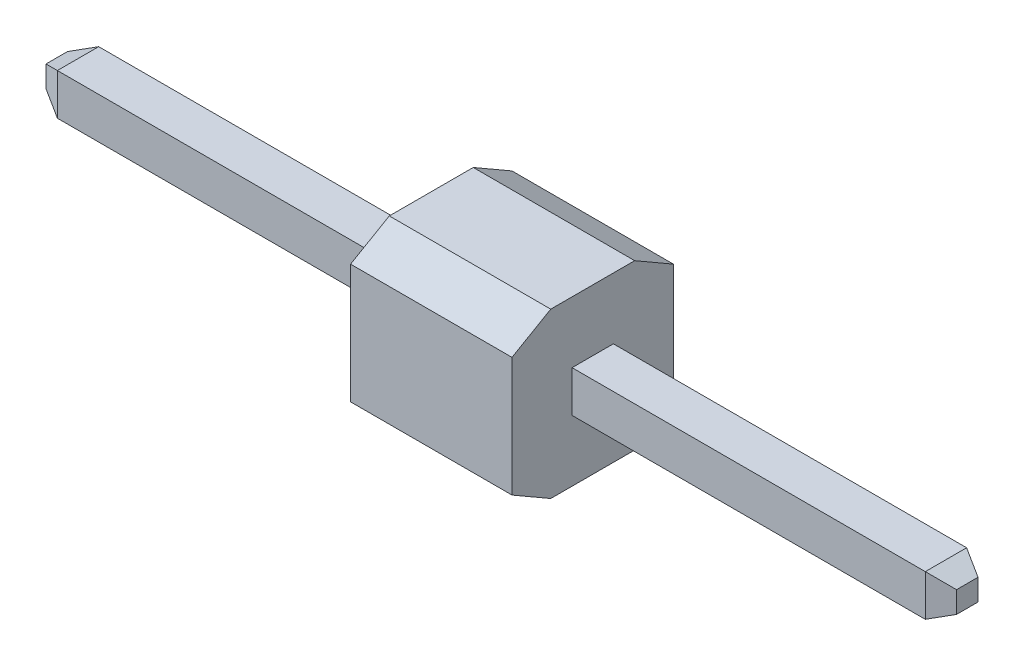
ISO-10303-21;
HEADER;
FILE_DESCRIPTION(('STEP AP214'),'2;1');
FILE_NAME('part.step','',(''),(''),'','','');
FILE_SCHEMA(('AUTOMOTIVE_DESIGN { 1 0 10303 214 1 1 1 1 }'));
ENDSEC;
DATA;
#1=APPLICATION_CONTEXT('core data for automotive mechanical design processes');
#2=APPLICATION_PROTOCOL_DEFINITION('international standard','automotive_design',2000,#1);
#3=PRODUCT_CONTEXT('',#1,'mechanical');
#4=PRODUCT('Part','Part','',(#3));
#5=PRODUCT_RELATED_PRODUCT_CATEGORY('part','',(#4));
#6=PRODUCT_DEFINITION_FORMATION('','',#4);
#7=PRODUCT_DEFINITION_CONTEXT('part definition',#1,'design');
#8=PRODUCT_DEFINITION('design','',#6,#7);
#9=PRODUCT_DEFINITION_SHAPE('','',#8);
#10=(LENGTH_UNIT() NAMED_UNIT(*) SI_UNIT(.MILLI.,.METRE.));
#11=(NAMED_UNIT(*) PLANE_ANGLE_UNIT() SI_UNIT($,.RADIAN.));
#12=(NAMED_UNIT(*) SI_UNIT($,.STERADIAN.) SOLID_ANGLE_UNIT());
#13=UNCERTAINTY_MEASURE_WITH_UNIT(LENGTH_MEASURE(1.E-05),#10,'distance_accuracy_value','');
#14=(GEOMETRIC_REPRESENTATION_CONTEXT(3) GLOBAL_UNCERTAINTY_ASSIGNED_CONTEXT((#13)) GLOBAL_UNIT_ASSIGNED_CONTEXT((#10,
#11,#12)) REPRESENTATION_CONTEXT('',''));
#15=CARTESIAN_POINT('',(0.,0.,0.));
#16=DIRECTION('',(0.,0.,1.));
#17=DIRECTION('',(1.,0.,0.));
#18=AXIS2_PLACEMENT_3D('',#15,#16,#17);
#19=CARTESIAN_POINT('',(5.4210759044697,2.85711572605714,-2.77112081761862));
#20=DIRECTION('',(1.,-9.93476518829084E-08,4.37113882867379E-08));
#21=DIRECTION('',(-9.93476589883358E-08,-1.,8.74227765734759E-08));
#22=AXIS2_PLACEMENT_3D('',#19,#20,#21);
#23=PLANE('',#22);
#24=DIRECTION('',(-1.18186632779335E-08,-0.50000007571054,-0.866025360072933));
#25=VECTOR('',#24,1.);
#26=CARTESIAN_POINT('',(5.42107571229509,1.61352602482091,-1.20112070890054));
#27=LINE('',#26,#25);
#28=CARTESIAN_POINT('',(5.42107571229509,1.61352602482091,-1.20112070890054));
#29=VERTEX_POINT('',#28);
#30=CARTESIAN_POINT('',(5.42107570410688,1.26711581085724,-1.8011206786164));
#31=VERTEX_POINT('',#30);
#32=EDGE_CURVE('E11',#29,#31,#27,.T.);
#33=ORIENTED_EDGE('',*,*,#32,.T.);
#34=DIRECTION('',(4.37113811813104E-08,-8.74227828590458E-08,-0.999999999999995));
#35=VECTOR('',#34,1.);
#36=CARTESIAN_POINT('',(5.42107570410688,1.26711581085724,-1.8011206786164));
#37=LINE('',#36,#35);
#38=CARTESIAN_POINT('',(5.42107576093168,1.26711569720762,-3.1011206786164));
#39=VERTEX_POINT('',#38);
#40=EDGE_CURVE('E304',#31,#39,#37,.T.);
#41=ORIENTED_EDGE('',*,*,#40,.T.);
#42=DIRECTION('',(8.75289963531795E-08,0.499999924289837,-0.866025447495713));
#43=VECTOR('',#42,1.);
#44=CARTESIAN_POINT('',(5.42107576093168,1.26711569720762,-3.1011206786164));
#45=LINE('',#44,#43);
#46=CARTESIAN_POINT('',(5.42107582157355,1.61352580626395,-3.70112070890054));
#47=VERTEX_POINT('',#46);
#48=EDGE_CURVE('E296',#39,#47,#45,.T.);
#49=ORIENTED_EDGE('',*,*,#48,.T.);
#50=DIRECTION('',(9.93476588436478E-08,0.999999999999991,-8.74227764822788E-08));
#51=VECTOR('',#50,1.);
#52=CARTESIAN_POINT('',(5.42107582157355,1.61352580626395,-3.70112070890054));
#53=LINE('',#52,#51);
#54=CARTESIAN_POINT('',(5.42107600508652,3.46070548323395,-3.70112087038612));
#55=VERTEX_POINT('',#54);
#56=EDGE_CURVE('E281',#47,#55,#53,.T.);
#57=ORIENTED_EDGE('',*,*,#56,.T.);
#58=DIRECTION('',(-1.18186619958731E-08,-0.500000075710537,-0.866025360072935));
#59=VECTOR('',#58,1.);
#60=CARTESIAN_POINT('',(5.42107601327473,3.80711569720762,-3.10112090067026));
#61=LINE('',#60,#59);
#62=CARTESIAN_POINT('',(5.42107601327473,3.80711569720762,-3.10112090067026));
#63=VERTEX_POINT('',#62);
#64=EDGE_CURVE('E265',#63,#55,#61,.T.);
#65=ORIENTED_EDGE('',*,*,#64,.F.);
#66=DIRECTION('',(4.37113811813104E-08,-8.74227814926175E-08,-0.999999999999995));
#67=VECTOR('',#66,1.);
#68=CARTESIAN_POINT('',(5.42107595644994,3.80711581085724,-1.80112090067026));
#69=LINE('',#68,#67);
#70=CARTESIAN_POINT('',(5.42107595644994,3.80711581085724,-1.80112090067026));
#71=VERTEX_POINT('',#70);
#72=EDGE_CURVE('E248',#71,#63,#69,.T.);
#73=ORIENTED_EDGE('',*,*,#72,.F.);
#74=DIRECTION('',(8.75289963525478E-08,0.499999924289836,-0.866025447495714));
#75=VECTOR('',#74,1.);
#76=CARTESIAN_POINT('',(5.42107589580807,3.46070570179091,-1.20112087038612));
#77=LINE('',#76,#75);
#78=CARTESIAN_POINT('',(5.42107589580807,3.46070570179091,-1.20112087038612));
#79=VERTEX_POINT('',#78);
#80=EDGE_CURVE('E242',#79,#71,#77,.T.);
#81=ORIENTED_EDGE('',*,*,#80,.F.);
#82=DIRECTION('',(9.93476588436478E-08,0.999999999999991,-8.74227763620714E-08));
#83=VECTOR('',#82,1.);
#84=CARTESIAN_POINT('',(5.42107571229509,1.61352602482091,-1.20112070890054));
#85=LINE('',#84,#83);
#86=EDGE_CURVE('E236',#29,#79,#85,.T.);
#87=ORIENTED_EDGE('',*,*,#86,.F.);
#88=EDGE_LOOP('',(#33,#41,#49,#57,#65,#73,#81,#87));
#89=FACE_BOUND('',#88,.T.);
#90=DIRECTION('',(-4.37113817364219E-08,8.74227801261891E-08,0.999999999999995));
#91=VECTOR('',#90,1.);
#92=CARTESIAN_POINT('',(5.4210758408872,2.21711572605714,-2.77112076166804));
#93=LINE('',#92,#91);
#94=CARTESIAN_POINT('',(5.4210758408872,2.21711572605714,-2.77112076166804));
#95=VERTEX_POINT('',#94);
#96=CARTESIAN_POINT('',(5.42107581291191,2.21711578200772,-2.13112076166804));
#97=VERTEX_POINT('',#96);
#98=EDGE_CURVE('E302',#95,#97,#93,.T.);
#99=ORIENTED_EDGE('',*,*,#98,.T.);
#100=DIRECTION('',(-9.93476592658908E-08,-0.999999999999991,8.7422776656742E-08));
#101=VECTOR('',#100,1.);
#102=CARTESIAN_POINT('',(5.42107587649442,2.85711578200772,-2.13112081761862));
#103=LINE('',#102,#101);
#104=CARTESIAN_POINT('',(5.42107587649442,2.85711578200772,-2.13112081761862));
#105=VERTEX_POINT('',#104);
#106=EDGE_CURVE('E293',#105,#97,#103,.T.);
#107=ORIENTED_EDGE('',*,*,#106,.F.);
#108=DIRECTION('',(-4.37113817364219E-08,8.74227829017466E-08,0.999999999999995));
#109=VECTOR('',#108,1.);
#110=CARTESIAN_POINT('',(5.4210759044697,2.85711572605714,-2.77112081761862));
#111=LINE('',#110,#109);
#112=CARTESIAN_POINT('',(5.4210759044697,2.85711572605714,-2.77112081761862));
#113=VERTEX_POINT('',#112);
#114=EDGE_CURVE('E278',#113,#105,#111,.T.);
#115=ORIENTED_EDGE('',*,*,#114,.F.);
#116=DIRECTION('',(-9.93476592658908E-08,-0.999999999999991,8.7422776656742E-08));
#117=VECTOR('',#116,1.);
#118=CARTESIAN_POINT('',(5.4210759044697,2.85711572605714,-2.77112081761862));
#119=LINE('',#118,#117);
#120=EDGE_CURVE('E263',#113,#95,#119,.T.);
#121=ORIENTED_EDGE('',*,*,#120,.T.);
#122=EDGE_LOOP('',(#99,#107,#115,#121));
#123=FACE_BOUND('',#122,.T.);
#124=ADVANCED_FACE('F17',(#89,#123),#23,.T.);
#125=CARTESIAN_POINT('',(2.9210759044697,2.85711597442627,-2.77112092689709));
#126=DIRECTION('',(1.,-9.93476518829084E-08,4.37113882867379E-08));
#127=DIRECTION('',(-9.93476589883358E-08,-1.,8.74227765734759E-08));
#128=AXIS2_PLACEMENT_3D('',#125,#126,#127);
#129=PLANE('',#128);
#130=DIRECTION('',(-1.18186632779335E-08,-0.50000007571054,-0.866025360072933));
#131=VECTOR('',#130,1.);
#132=CARTESIAN_POINT('',(2.92107571229509,1.61352627319004,-1.20112081817901));
#133=LINE('',#132,#131);
#134=CARTESIAN_POINT('',(2.92107571229509,1.61352627319004,-1.20112081817901));
#135=VERTEX_POINT('',#134);
#136=CARTESIAN_POINT('',(2.92107570410688,1.26711605922637,-1.80112078789487));
#137=VERTEX_POINT('',#136);
#138=EDGE_CURVE('E24',#135,#137,#133,.T.);
#139=ORIENTED_EDGE('',*,*,#138,.F.);
#140=DIRECTION('',(9.93476588436478E-08,0.999999999999991,-8.74227763620714E-08));
#141=VECTOR('',#140,1.);
#142=CARTESIAN_POINT('',(2.92107571229509,1.61352627319004,-1.20112081817901));
#143=LINE('',#142,#141);
#144=CARTESIAN_POINT('',(2.92107589580807,3.46070595016004,-1.20112097966459));
#145=VERTEX_POINT('',#144);
#146=EDGE_CURVE('E300',#135,#145,#143,.T.);
#147=ORIENTED_EDGE('',*,*,#146,.T.);
#148=DIRECTION('',(8.75289963525478E-08,0.499999924289836,-0.866025447495714));
#149=VECTOR('',#148,1.);
#150=CARTESIAN_POINT('',(2.92107589580807,3.46070595016004,-1.20112097966459));
#151=LINE('',#150,#149);
#152=CARTESIAN_POINT('',(2.92107595644994,3.80711605922637,-1.80112100994873));
#153=VERTEX_POINT('',#152);
#154=EDGE_CURVE('E286',#145,#153,#151,.T.);
#155=ORIENTED_EDGE('',*,*,#154,.T.);
#156=DIRECTION('',(4.37113811813104E-08,-8.74227814926175E-08,-0.999999999999995));
#157=VECTOR('',#156,1.);
#158=CARTESIAN_POINT('',(2.92107595644994,3.80711605922637,-1.80112100994873));
#159=LINE('',#158,#157);
#160=CARTESIAN_POINT('',(2.92107601327473,3.80711594557675,-3.10112100994873));
#161=VERTEX_POINT('',#160);
#162=EDGE_CURVE('E271',#153,#161,#159,.T.);
#163=ORIENTED_EDGE('',*,*,#162,.T.);
#164=DIRECTION('',(-1.18186626368607E-08,-0.500000075710537,-0.866025360072935));
#165=VECTOR('',#164,1.);
#166=CARTESIAN_POINT('',(2.92107601327473,3.80711594557675,-3.10112100994873));
#167=LINE('',#166,#165);
#168=CARTESIAN_POINT('',(2.92107600508652,3.46070573160308,-3.70112097966459));
#169=VERTEX_POINT('',#168);
#170=EDGE_CURVE('E253',#161,#169,#167,.T.);
#171=ORIENTED_EDGE('',*,*,#170,.T.);
#172=DIRECTION('',(9.93476588436478E-08,0.999999999999991,-8.74227764822788E-08));
#173=VECTOR('',#172,1.);
#174=CARTESIAN_POINT('',(2.92107582157355,1.61352605463308,-3.70112081817901));
#175=LINE('',#174,#173);
#176=CARTESIAN_POINT('',(2.92107582157355,1.61352605463308,-3.70112081817901));
#177=VERTEX_POINT('',#176);
#178=EDGE_CURVE('E261',#177,#169,#175,.T.);
#179=ORIENTED_EDGE('',*,*,#178,.F.);
#180=DIRECTION('',(8.75289963531795E-08,0.499999924289837,-0.866025447495713));
#181=VECTOR('',#180,1.);
#182=CARTESIAN_POINT('',(2.92107576093168,1.26711594557675,-3.10112078789487));
#183=LINE('',#182,#181);
#184=CARTESIAN_POINT('',(2.92107576093168,1.26711594557675,-3.10112078789487));
#185=VERTEX_POINT('',#184);
#186=EDGE_CURVE('E276',#185,#177,#183,.T.);
#187=ORIENTED_EDGE('',*,*,#186,.F.);
#188=DIRECTION('',(4.37113811813104E-08,-8.74227828590458E-08,-0.999999999999995));
#189=VECTOR('',#188,1.);
#190=CARTESIAN_POINT('',(2.92107570410688,1.26711605922637,-1.80112078789487));
#191=LINE('',#190,#189);
#192=EDGE_CURVE('E291',#137,#185,#191,.T.);
#193=ORIENTED_EDGE('',*,*,#192,.F.);
#194=EDGE_LOOP('',(#139,#147,#155,#163,#171,#179,#187,#193));
#195=FACE_BOUND('',#194,.T.);
#196=DIRECTION('',(-9.93476585720014E-08,-0.999999999999991,8.7422776656742E-08));
#197=VECTOR('',#196,1.);
#198=CARTESIAN_POINT('',(2.92107587649442,2.85711603037685,-2.13112092689709));
#199=LINE('',#198,#197);
#200=CARTESIAN_POINT('',(2.92107587649442,2.85711603037685,-2.13112092689709));
#201=VERTEX_POINT('',#200);
#202=CARTESIAN_POINT('',(2.92107581291191,2.21711603037685,-2.13112087094651));
#203=VERTEX_POINT('',#202);
#204=EDGE_CURVE('E298',#201,#203,#199,.T.);
#205=ORIENTED_EDGE('',*,*,#204,.T.);
#206=DIRECTION('',(-4.37113810425325E-08,8.74227801261891E-08,0.999999999999995));
#207=VECTOR('',#206,1.);
#208=CARTESIAN_POINT('',(2.9210758408872,2.21711597442627,-2.77112087094651));
#209=LINE('',#208,#207);
#210=CARTESIAN_POINT('',(2.9210758408872,2.21711597442627,-2.77112087094651));
#211=VERTEX_POINT('',#210);
#212=EDGE_CURVE('E283',#211,#203,#209,.T.);
#213=ORIENTED_EDGE('',*,*,#212,.F.);
#214=DIRECTION('',(-9.93476592658908E-08,-0.999999999999991,8.7422776656742E-08));
#215=VECTOR('',#214,1.);
#216=CARTESIAN_POINT('',(2.9210759044697,2.85711597442627,-2.77112092689709));
#217=LINE('',#216,#215);
#218=CARTESIAN_POINT('',(2.9210759044697,2.85711597442627,-2.77112092689709));
#219=VERTEX_POINT('',#218);
#220=EDGE_CURVE('E268',#219,#211,#217,.T.);
#221=ORIENTED_EDGE('',*,*,#220,.F.);
#222=DIRECTION('',(-4.37113817364219E-08,8.74227829017466E-08,0.999999999999995));
#223=VECTOR('',#222,1.);
#224=CARTESIAN_POINT('',(2.9210759044697,2.85711597442627,-2.77112092689709));
#225=LINE('',#224,#223);
#226=EDGE_CURVE('E251',#219,#201,#225,.T.);
#227=ORIENTED_EDGE('',*,*,#226,.T.);
#228=EDGE_LOOP('',(#205,#213,#221,#227));
#229=FACE_BOUND('',#228,.T.);
#230=ADVANCED_FACE('F314',(#195,#229),#129,.F.);
#231=CARTESIAN_POINT('',(5.42107571229509,1.61352602482091,-1.20112070890054));
#232=DIRECTION('',(1.07893287081065E-07,0.866025360072937,-0.500000075710535));
#233=DIRECTION('',(1.18186629566715E-08,0.500000075710542,0.866025360072941));
#234=AXIS2_PLACEMENT_3D('',#231,#232,#233);
#235=PLANE('',#234);
#236=ORIENTED_EDGE('',*,*,#138,.T.);
#237=DIRECTION('',(-0.999999999999994,9.93476511723651E-08,-4.37113884643734E-08));
#238=VECTOR('',#237,1.);
#239=CARTESIAN_POINT('',(5.42107570410688,1.26711581085724,-1.8011206786164));
#240=LINE('',#239,#238);
#241=EDGE_CURVE('E288',#31,#137,#240,.T.);
#242=ORIENTED_EDGE('',*,*,#241,.F.);
#243=ORIENTED_EDGE('',*,*,#32,.F.);
#244=DIRECTION('',(-0.999999999999994,9.93476518829078E-08,-4.3711388109102E-08));
#245=VECTOR('',#244,1.);
#246=CARTESIAN_POINT('',(5.42107571229509,1.61352602482091,-1.20112070890054));
#247=LINE('',#246,#245);
#248=EDGE_CURVE('E256',#29,#135,#247,.T.);
#249=ORIENTED_EDGE('',*,*,#248,.T.);
#250=EDGE_LOOP('',(#236,#242,#243,#249));
#251=FACE_BOUND('',#250,.T.);
#252=ADVANCED_FACE('F306',(#251),#235,.F.);
#253=CARTESIAN_POINT('',(5.42107570410688,1.26711581085724,-1.8011206786164));
#254=DIRECTION('',(9.93476589883358E-08,1.,-8.74227765734759E-08));
#255=DIRECTION('',(1.,-9.93476518829084E-08,4.37113882867379E-08));
#256=AXIS2_PLACEMENT_3D('',#253,#254,#255);
#257=PLANE('',#256);
#258=ORIENTED_EDGE('',*,*,#192,.T.);
#259=DIRECTION('',(-0.999999999999994,9.93476511723651E-08,-4.37113882867377E-08));
#260=VECTOR('',#259,1.);
#261=CARTESIAN_POINT('',(5.42107576093168,1.26711569720762,-3.1011206786164));
#262=LINE('',#261,#260);
#263=EDGE_CURVE('E273',#39,#185,#262,.T.);
#264=ORIENTED_EDGE('',*,*,#263,.F.);
#265=ORIENTED_EDGE('',*,*,#40,.F.);
#266=ORIENTED_EDGE('',*,*,#241,.T.);
#267=EDGE_LOOP('',(#258,#264,#265,#266));
#268=FACE_BOUND('',#267,.T.);
#269=ADVANCED_FACE('F311',(#268),#257,.F.);
#270=CARTESIAN_POINT('',(5.42107576093168,1.26711569720762,-3.1011206786164));
#271=DIRECTION('',(6.41819058997377E-08,0.866025447495721,0.499999924289845));
#272=DIRECTION('',(-8.7528996031702E-08,-0.499999924289838,0.866025447495717));
#273=AXIS2_PLACEMENT_3D('',#270,#271,#272);
#274=PLANE('',#273);
#275=ORIENTED_EDGE('',*,*,#186,.T.);
#276=DIRECTION('',(-0.999999999999994,9.93476518829078E-08,-4.37113882867377E-08));
#277=VECTOR('',#276,1.);
#278=CARTESIAN_POINT('',(5.42107582157355,1.61352580626395,-3.70112070890054));
#279=LINE('',#278,#277);
#280=EDGE_CURVE('E258',#47,#177,#279,.T.);
#281=ORIENTED_EDGE('',*,*,#280,.F.);
#282=ORIENTED_EDGE('',*,*,#48,.F.);
#283=ORIENTED_EDGE('',*,*,#263,.T.);
#284=EDGE_LOOP('',(#275,#281,#282,#283));
#285=FACE_BOUND('',#284,.T.);
#286=ADVANCED_FACE('F319',(#285),#274,.F.);
#287=CARTESIAN_POINT('',(5.42107582157355,1.61352580626395,-3.70112070890054));
#288=DIRECTION('',(-4.37113811813106E-08,8.74227836789032E-08,1.));
#289=DIRECTION('',(-1.,9.93476518829084E-08,-4.37113882867379E-08));
#290=AXIS2_PLACEMENT_3D('',#287,#288,#289);
#291=PLANE('',#290);
#292=ORIENTED_EDGE('',*,*,#178,.T.);
#293=DIRECTION('',(-0.999999999999994,9.93476518829078E-08,-4.37113884643734E-08));
#294=VECTOR('',#293,1.);
#295=CARTESIAN_POINT('',(5.42107600508652,3.46070548323395,-3.70112087038612));
#296=LINE('',#295,#294);
#297=EDGE_CURVE('E245',#55,#169,#296,.T.);
#298=ORIENTED_EDGE('',*,*,#297,.F.);
#299=ORIENTED_EDGE('',*,*,#56,.F.);
#300=ORIENTED_EDGE('',*,*,#280,.T.);
#301=EDGE_LOOP('',(#292,#298,#299,#300));
#302=FACE_BOUND('',#301,.T.);
#303=ADVANCED_FACE('F326',(#302),#291,.F.);
#304=CARTESIAN_POINT('',(5.42107601327473,3.80711569720762,-3.10112090067026));
#305=DIRECTION('',(1.07893287081065E-07,0.866025360072937,-0.500000075710535));
#306=DIRECTION('',(1.18186629566715E-08,0.500000075710542,0.866025360072941));
#307=AXIS2_PLACEMENT_3D('',#304,#305,#306);
#308=PLANE('',#307);
#309=ORIENTED_EDGE('',*,*,#170,.F.);
#310=DIRECTION('',(-0.999999999999994,9.93476504618223E-08,-4.37113882867377E-08));
#311=VECTOR('',#310,1.);
#312=CARTESIAN_POINT('',(5.42107601327473,3.80711569720762,-3.10112090067026));
#313=LINE('',#312,#311);
#314=EDGE_CURVE('E239',#63,#161,#313,.T.);
#315=ORIENTED_EDGE('',*,*,#314,.F.);
#316=ORIENTED_EDGE('',*,*,#64,.T.);
#317=ORIENTED_EDGE('',*,*,#297,.T.);
#318=EDGE_LOOP('',(#309,#315,#316,#317));
#319=FACE_BOUND('',#318,.T.);
#320=ADVANCED_FACE('F329',(#319),#308,.T.);
#321=CARTESIAN_POINT('',(5.42107595644994,3.80711581085724,-1.80112090067026));
#322=DIRECTION('',(9.93476589883358E-08,1.,-8.74227765734759E-08));
#323=DIRECTION('',(1.,-9.93476518829084E-08,4.37113882867379E-08));
#324=AXIS2_PLACEMENT_3D('',#321,#322,#323);
#325=PLANE('',#324);
#326=ORIENTED_EDGE('',*,*,#162,.F.);
#327=DIRECTION('',(-0.999999999999994,9.93476504618223E-08,-4.37113883755555E-08));
#328=VECTOR('',#327,1.);
#329=CARTESIAN_POINT('',(5.42107595644994,3.80711581085724,-1.80112090067026));
#330=LINE('',#329,#328);
#331=EDGE_CURVE('E233',#71,#153,#330,.T.);
#332=ORIENTED_EDGE('',*,*,#331,.F.);
#333=ORIENTED_EDGE('',*,*,#72,.T.);
#334=ORIENTED_EDGE('',*,*,#314,.T.);
#335=EDGE_LOOP('',(#326,#332,#333,#334));
#336=FACE_BOUND('',#335,.T.);
#337=ADVANCED_FACE('F333',(#336),#325,.T.);
#338=CARTESIAN_POINT('',(5.42107589580807,3.46070570179091,-1.20112087038612));
#339=DIRECTION('',(6.41819058997377E-08,0.866025447495721,0.499999924289845));
#340=DIRECTION('',(-8.7528996031702E-08,-0.499999924289838,0.866025447495717));
#341=AXIS2_PLACEMENT_3D('',#338,#339,#340);
#342=PLANE('',#341);
#343=ORIENTED_EDGE('',*,*,#154,.F.);
#344=DIRECTION('',(-0.999999999999994,9.93476518829078E-08,-4.3711388109102E-08));
#345=VECTOR('',#344,1.);
#346=CARTESIAN_POINT('',(5.42107589580807,3.46070570179091,-1.20112087038612));
#347=LINE('',#346,#345);
#348=EDGE_CURVE('E230',#79,#145,#347,.T.);
#349=ORIENTED_EDGE('',*,*,#348,.F.);
#350=ORIENTED_EDGE('',*,*,#80,.T.);
#351=ORIENTED_EDGE('',*,*,#331,.T.);
#352=EDGE_LOOP('',(#343,#349,#350,#351));
#353=FACE_BOUND('',#352,.T.);
#354=ADVANCED_FACE('F337',(#353),#342,.T.);
#355=CARTESIAN_POINT('',(5.42107571229509,1.61352602482091,-1.20112070890054));
#356=DIRECTION('',(-4.37113811813106E-08,8.74227835615132E-08,1.));
#357=DIRECTION('',(-9.93476589883358E-08,-1.,8.74227764560859E-08));
#358=AXIS2_PLACEMENT_3D('',#355,#356,#357);
#359=PLANE('',#358);
#360=ORIENTED_EDGE('',*,*,#146,.F.);
#361=ORIENTED_EDGE('',*,*,#248,.F.);
#362=ORIENTED_EDGE('',*,*,#86,.T.);
#363=ORIENTED_EDGE('',*,*,#348,.T.);
#364=EDGE_LOOP('',(#360,#361,#362,#363));
#365=FACE_BOUND('',#364,.T.);
#366=ADVANCED_FACE('F339',(#365),#359,.T.);
#367=CARTESIAN_POINT('',(-2.8789240955303,2.85711655064265,-2.77112118042314));
#368=DIRECTION('',(-1.,9.93476518829084E-08,-4.37113882867379E-08));
#369=DIRECTION('',(9.93476589883358E-08,1.,-8.74227765734759E-08));
#370=AXIS2_PLACEMENT_3D('',#367,#368,#369);
#371=PLANE('',#370);
#372=DIRECTION('',(9.93476554744631E-08,0.999999999999991,-8.74227761415115E-08));
#373=VECTOR('',#372,1.);
#374=CARTESIAN_POINT('',(-2.87892416507394,2.37099812033048,-2.28500266511631));
#375=LINE('',#374,#373);
#376=CARTESIAN_POINT('',(-2.87892416507394,2.37099812033048,-2.28500266511631));
#377=VERTEX_POINT('',#376);
#378=CARTESIAN_POINT('',(-2.87892413206698,2.70323506594048,-2.28500269416139));
#379=VERTEX_POINT('',#378);
#380=EDGE_CURVE('E228',#377,#379,#375,.T.);
#381=ORIENTED_EDGE('',*,*,#380,.T.);
#382=DIRECTION('',(4.37113820547149E-08,-8.74227694560864E-08,-0.999999999999995));
#383=VECTOR('',#382,1.);
#384=CARTESIAN_POINT('',(-2.87892413206698,2.70323506594048,-2.28500269416139));
#385=LINE('',#384,#383);
#386=CARTESIAN_POINT('',(-2.87892411754444,2.7032350368954,-2.61723963977939));
#387=VERTEX_POINT('',#386);
#388=EDGE_CURVE('E223',#379,#387,#385,.T.);
#389=ORIENTED_EDGE('',*,*,#388,.T.);
#390=DIRECTION('',(-9.93476634944484E-08,-0.999999999999991,8.7422776141512E-08));
#391=VECTOR('',#390,1.);
#392=CARTESIAN_POINT('',(-2.87892411754444,2.7032350368954,-2.61723963977939));
#393=LINE('',#392,#391);
#394=CARTESIAN_POINT('',(-2.87892415055141,2.3709980912854,-2.61723961073432));
#395=VERTEX_POINT('',#394);
#396=EDGE_CURVE('E215',#387,#395,#393,.T.);
#397=ORIENTED_EDGE('',*,*,#396,.T.);
#398=DIRECTION('',(-4.37113740347301E-08,8.74227801493995E-08,0.999999999999995));
#399=VECTOR('',#398,1.);
#400=CARTESIAN_POINT('',(-2.87892415055141,2.3709980912854,-2.61723961073432));
#401=LINE('',#400,#399);
#402=EDGE_CURVE('E207',#395,#377,#401,.T.);
#403=ORIENTED_EDGE('',*,*,#402,.T.);
#404=EDGE_LOOP('',(#381,#389,#397,#403));
#405=FACE_BOUND('',#404,.T.);
#406=ADVANCED_FACE('F341',(#405),#371,.T.);
#407=CARTESIAN_POINT('',(-2.8789240955303,2.85711655064265,-2.77112118042314));
#408=DIRECTION('',(9.93476589883358E-08,1.,-8.74227764510112E-08));
#409=DIRECTION('',(-4.37113811813106E-08,8.74227835564385E-08,1.));
#410=AXIS2_PLACEMENT_3D('',#407,#408,#409);
#411=PLANE('',#410);
#412=DIRECTION('',(0.999999999999994,-9.93476527532252E-08,4.37113882769953E-08));
#413=VECTOR('',#412,1.);
#414=CARTESIAN_POINT('',(-2.5489240955303,2.85711651785793,-2.77112116599838));
#415=LINE('',#414,#413);
#416=CARTESIAN_POINT('',(-2.5489240955303,2.85711651785793,-2.77112116599838));
#417=VERTEX_POINT('',#416);
#418=EDGE_CURVE('E225',#417,#219,#415,.T.);
#419=ORIENTED_EDGE('',*,*,#418,.F.);
#420=DIRECTION('',(-4.37113817364219E-08,8.74227829017466E-08,0.999999999999995));
#421=VECTOR('',#420,1.);
#422=CARTESIAN_POINT('',(-2.5489240955303,2.85711651785793,-2.77112116599838));
#423=LINE('',#422,#421);
#424=CARTESIAN_POINT('',(-2.54892412350558,2.85711657380851,-2.13112116599838));
#425=VERTEX_POINT('',#424);
#426=EDGE_CURVE('E217',#417,#425,#423,.T.);
#427=ORIENTED_EDGE('',*,*,#426,.T.);
#428=DIRECTION('',(0.999999999999994,-9.93476527532252E-08,4.3711388195809E-08));
#429=VECTOR('',#428,1.);
#430=CARTESIAN_POINT('',(-2.54892412350558,2.85711657380851,-2.13112116599838));
#431=LINE('',#430,#429);
#432=EDGE_CURVE('E220',#425,#201,#431,.T.);
#433=ORIENTED_EDGE('',*,*,#432,.T.);
#434=ORIENTED_EDGE('',*,*,#226,.F.);
#435=EDGE_LOOP('',(#419,#427,#433,#434));
#436=FACE_BOUND('',#435,.T.);
#437=ADVANCED_FACE('F348',(#436),#411,.T.);
#438=CARTESIAN_POINT('',(-2.87892412350558,2.85711660659323,-2.13112118042314));
#439=DIRECTION('',(-4.37113811813106E-08,8.74227836789032E-08,1.));
#440=DIRECTION('',(-1.,9.93476518829084E-08,-4.37113882867379E-08));
#441=AXIS2_PLACEMENT_3D('',#438,#439,#440);
#442=PLANE('',#441);
#443=ORIENTED_EDGE('',*,*,#432,.F.);
#444=DIRECTION('',(-9.93476592658908E-08,-0.999999999999991,8.74227759628526E-08));
#445=VECTOR('',#444,1.);
#446=CARTESIAN_POINT('',(-2.54892412350558,2.85711657380851,-2.13112116599838));
#447=LINE('',#446,#445);
#448=CARTESIAN_POINT('',(-2.54892418708809,2.21711657380851,-2.13112111004781));
#449=VERTEX_POINT('',#448);
#450=EDGE_CURVE('E209',#425,#449,#447,.T.);
#451=ORIENTED_EDGE('',*,*,#450,.T.);
#452=DIRECTION('',(0.999999999999994,-9.93476524284799E-08,4.37113882769953E-08));
#453=VECTOR('',#452,1.);
#454=CARTESIAN_POINT('',(-2.54892418708809,2.2171165738085,-2.13112111004781));
#455=LINE('',#454,#453);
#456=EDGE_CURVE('E212',#449,#203,#455,.T.);
#457=ORIENTED_EDGE('',*,*,#456,.T.);
#458=ORIENTED_EDGE('',*,*,#204,.F.);
#459=EDGE_LOOP('',(#443,#451,#457,#458));
#460=FACE_BOUND('',#459,.T.);
#461=ADVANCED_FACE('F424',(#460),#442,.T.);
#462=CARTESIAN_POINT('',(-2.8789241591128,2.21711655064265,-2.77112112447256));
#463=DIRECTION('',(9.93476589883357E-08,1.,-8.74227764040693E-08));
#464=DIRECTION('',(-4.37113811813106E-08,8.74227835094966E-08,1.));
#465=AXIS2_PLACEMENT_3D('',#462,#463,#464);
#466=PLANE('',#465);
#467=ORIENTED_EDGE('',*,*,#456,.F.);
#468=DIRECTION('',(4.37113831242007E-08,-8.74227884528619E-08,-0.999999999999995));
#469=VECTOR('',#468,1.);
#470=CARTESIAN_POINT('',(-2.54892418708809,2.21711657380851,-2.13112111004781));
#471=LINE('',#470,#469);
#472=CARTESIAN_POINT('',(-2.5489241591128,2.21711651785792,-2.77112111004781));
#473=VERTEX_POINT('',#472);
#474=EDGE_CURVE('E201',#449,#473,#471,.T.);
#475=ORIENTED_EDGE('',*,*,#474,.T.);
#476=DIRECTION('',(0.999999999999994,-9.93476524284799E-08,4.37113882769953E-08));
#477=VECTOR('',#476,1.);
#478=CARTESIAN_POINT('',(-2.5489241591128,2.21711651785792,-2.77112111004781));
#479=LINE('',#478,#477);
#480=EDGE_CURVE('E204',#473,#211,#479,.T.);
#481=ORIENTED_EDGE('',*,*,#480,.T.);
#482=ORIENTED_EDGE('',*,*,#212,.T.);
#483=EDGE_LOOP('',(#467,#475,#481,#482));
#484=FACE_BOUND('',#483,.T.);
#485=ADVANCED_FACE('F421',(#484),#466,.F.);
#486=CARTESIAN_POINT('',(-2.8789240955303,2.85711655064265,-2.77112118042314));
#487=DIRECTION('',(-4.37113811813106E-08,8.74227836789032E-08,1.));
#488=DIRECTION('',(-1.,9.93476518829084E-08,-4.37113882867379E-08));
#489=AXIS2_PLACEMENT_3D('',#486,#487,#488);
#490=PLANE('',#489);
#491=ORIENTED_EDGE('',*,*,#480,.F.);
#492=DIRECTION('',(9.93476606536696E-08,0.999999999999991,-8.7422776656742E-08));
#493=VECTOR('',#492,1.);
#494=CARTESIAN_POINT('',(-2.5489241591128,2.21711651785793,-2.77112111004781));
#495=LINE('',#494,#493);
#496=EDGE_CURVE('E196',#473,#417,#495,.T.);
#497=ORIENTED_EDGE('',*,*,#496,.T.);
#498=ORIENTED_EDGE('',*,*,#418,.T.);
#499=ORIENTED_EDGE('',*,*,#220,.T.);
#500=EDGE_LOOP('',(#491,#497,#498,#499));
#501=FACE_BOUND('',#500,.T.);
#502=ADVANCED_FACE('F376',(#501),#490,.F.);
#503=CARTESIAN_POINT('',(-2.8789240955303,2.85711655064265,-2.77112118042314));
#504=DIRECTION('',(-4.37113811813106E-08,8.74227836789032E-08,1.));
#505=DIRECTION('',(-1.,9.93476518829084E-08,-4.37113882867379E-08));
#506=AXIS2_PLACEMENT_3D('',#503,#504,#505);
#507=PLANE('',#506);
#508=DIRECTION('',(0.999999999999994,-9.93476569749143E-08,4.37113882769953E-08));
#509=VECTOR('',#508,1.);
#510=CARTESIAN_POINT('',(5.4210759044697,2.85711572605715,-2.77112081761862));
#511=LINE('',#510,#509);
#512=CARTESIAN_POINT('',(10.8910759044697,2.85711518262548,-2.77112057851732));
#513=VERTEX_POINT('',#512);
#514=EDGE_CURVE('E199',#113,#513,#511,.T.);
#515=ORIENTED_EDGE('',*,*,#514,.T.);
#516=DIRECTION('',(-9.93476606536696E-08,-0.999999999999991,8.7422776656742E-08));
#517=VECTOR('',#516,1.);
#518=CARTESIAN_POINT('',(10.8910759044697,2.85711518262548,-2.77112057851732));
#519=LINE('',#518,#517);
#520=CARTESIAN_POINT('',(10.8910758408872,2.21711518262548,-2.77112052256675));
#521=VERTEX_POINT('',#520);
#522=EDGE_CURVE('E191',#513,#521,#519,.T.);
#523=ORIENTED_EDGE('',*,*,#522,.T.);
#524=DIRECTION('',(0.999999999999994,-9.93476465830644E-08,4.37113882769953E-08));
#525=VECTOR('',#524,1.);
#526=CARTESIAN_POINT('',(5.4210758408872,2.21711572605713,-2.77112076166804));
#527=LINE('',#526,#525);
#528=EDGE_CURVE('E194',#95,#521,#527,.T.);
#529=ORIENTED_EDGE('',*,*,#528,.F.);
#530=ORIENTED_EDGE('',*,*,#120,.F.);
#531=EDGE_LOOP('',(#515,#523,#529,#530));
#532=FACE_BOUND('',#531,.T.);
#533=ADVANCED_FACE('F367',(#532),#507,.F.);
#534=CARTESIAN_POINT('',(-2.8789241591128,2.21711655064265,-2.77112112447256));
#535=DIRECTION('',(9.93476589883357E-08,1.,-8.74227764040693E-08));
#536=DIRECTION('',(-4.37113811813106E-08,8.74227835094966E-08,1.));
#537=AXIS2_PLACEMENT_3D('',#534,#535,#536);
#538=PLANE('',#537);
#539=ORIENTED_EDGE('',*,*,#528,.T.);
#540=DIRECTION('',(-4.37113817364219E-08,8.74227801261892E-08,0.999999999999995));
#541=VECTOR('',#540,1.);
#542=CARTESIAN_POINT('',(10.8910758408872,2.21711518262548,-2.77112052256675));
#543=LINE('',#542,#541);
#544=CARTESIAN_POINT('',(10.8910758129119,2.21711523857607,-2.13112052256675));
#545=VERTEX_POINT('',#544);
#546=EDGE_CURVE('E186',#521,#545,#543,.T.);
#547=ORIENTED_EDGE('',*,*,#546,.T.);
#548=DIRECTION('',(0.999999999999994,-9.93476465830644E-08,4.37113881146227E-08));
#549=VECTOR('',#548,1.);
#550=CARTESIAN_POINT('',(5.42107581291191,2.21711578200772,-2.13112076166804));
#551=LINE('',#550,#549);
#552=EDGE_CURVE('E189',#97,#545,#551,.T.);
#553=ORIENTED_EDGE('',*,*,#552,.F.);
#554=ORIENTED_EDGE('',*,*,#98,.F.);
#555=EDGE_LOOP('',(#539,#547,#553,#554));
#556=FACE_BOUND('',#555,.T.);
#557=ADVANCED_FACE('F364',(#556),#538,.F.);
#558=CARTESIAN_POINT('',(-2.87892412350558,2.85711660659323,-2.13112118042314));
#559=DIRECTION('',(-4.37113811813106E-08,8.74227836789032E-08,1.));
#560=DIRECTION('',(-1.,9.93476518829084E-08,-4.37113882867379E-08));
#561=AXIS2_PLACEMENT_3D('',#558,#559,#560);
#562=PLANE('',#561);
#563=ORIENTED_EDGE('',*,*,#552,.T.);
#564=DIRECTION('',(9.93476578781121E-08,0.999999999999991,-8.74227759628526E-08));
#565=VECTOR('',#564,1.);
#566=CARTESIAN_POINT('',(10.8910758129119,2.21711523857607,-2.13112052256675));
#567=LINE('',#566,#565);
#568=CARTESIAN_POINT('',(10.8910758764944,2.85711523857607,-2.13112057851732));
#569=VERTEX_POINT('',#568);
#570=EDGE_CURVE('E176',#545,#569,#567,.T.);
#571=ORIENTED_EDGE('',*,*,#570,.T.);
#572=DIRECTION('',(0.999999999999994,-9.93476569749143E-08,4.37113881146227E-08));
#573=VECTOR('',#572,1.);
#574=CARTESIAN_POINT('',(5.42107587649442,2.85711578200773,-2.13112081761862));
#575=LINE('',#574,#573);
#576=EDGE_CURVE('E179',#105,#569,#575,.T.);
#577=ORIENTED_EDGE('',*,*,#576,.F.);
#578=ORIENTED_EDGE('',*,*,#106,.T.);
#579=EDGE_LOOP('',(#563,#571,#577,#578));
#580=FACE_BOUND('',#579,.T.);
#581=ADVANCED_FACE('F366',(#580),#562,.T.);
#582=CARTESIAN_POINT('',(-2.8789240955303,2.85711655064265,-2.77112118042314));
#583=DIRECTION('',(9.93476589883358E-08,1.,-8.74227764510112E-08));
#584=DIRECTION('',(-4.37113811813106E-08,8.74227835564385E-08,1.));
#585=AXIS2_PLACEMENT_3D('',#582,#583,#584);
#586=PLANE('',#585);
#587=ORIENTED_EDGE('',*,*,#576,.T.);
#588=DIRECTION('',(4.37113817364219E-08,-8.74227829017466E-08,-0.999999999999995));
#589=VECTOR('',#588,1.);
#590=CARTESIAN_POINT('',(10.8910758764944,2.85711523857607,-2.13112057851732));
#591=LINE('',#590,#589);
#592=EDGE_CURVE('E167',#569,#513,#591,.T.);
#593=ORIENTED_EDGE('',*,*,#592,.T.);
#594=ORIENTED_EDGE('',*,*,#514,.F.);
#595=ORIENTED_EDGE('',*,*,#114,.T.);
#596=EDGE_LOOP('',(#587,#593,#594,#595));
#597=FACE_BOUND('',#596,.T.);
#598=ADVANCED_FACE('F373',(#597),#586,.T.);
#599=CARTESIAN_POINT('',(11.2210759044697,2.85711514984076,-2.77112056409257));
#600=DIRECTION('',(-1.,9.93476518829084E-08,-4.37113882867379E-08));
#601=DIRECTION('',(9.93476589883358E-08,1.,-8.74227765734759E-08));
#602=AXIS2_PLACEMENT_3D('',#599,#600,#601);
#603=PLANE('',#602);
#604=DIRECTION('',(-9.93476581477919E-08,-0.999999999999991,8.7422776141512E-08));
#605=VECTOR('',#604,1.);
#606=CARTESIAN_POINT('',(11.221075867933,2.70323366513859,-2.28500207783082));
#607=LINE('',#606,#605);
#608=CARTESIAN_POINT('',(11.221075867933,2.70323366513859,-2.28500207783082));
#609=VERTEX_POINT('',#608);
#610=CARTESIAN_POINT('',(11.2210758349261,2.37099671952859,-2.28500204878574));
#611=VERTEX_POINT('',#610);
#612=EDGE_CURVE('E153',#609,#611,#607,.T.);
#613=ORIENTED_EDGE('',*,*,#612,.T.);
#614=DIRECTION('',(4.37113820547149E-08,-8.74227854960561E-08,-0.999999999999995));
#615=VECTOR('',#614,1.);
#616=CARTESIAN_POINT('',(11.2210758349261,2.37099671952859,-2.28500204878574));
#617=LINE('',#616,#615);
#618=CARTESIAN_POINT('',(11.2210758494486,2.37099669048351,-2.61723899440374));
#619=VERTEX_POINT('',#618);
#620=EDGE_CURVE('E395',#611,#619,#617,.T.);
#621=ORIENTED_EDGE('',*,*,#620,.T.);
#622=DIRECTION('',(9.93476581477913E-08,0.999999999999991,-8.74227761415115E-08));
#623=VECTOR('',#622,1.);
#624=CARTESIAN_POINT('',(11.2210758494486,2.37099669048351,-2.61723899440374));
#625=LINE('',#624,#623);
#626=CARTESIAN_POINT('',(11.2210758824556,2.70323363609351,-2.61723902344882));
#627=VERTEX_POINT('',#626);
#628=EDGE_CURVE('E156',#619,#627,#625,.T.);
#629=ORIENTED_EDGE('',*,*,#628,.T.);
#630=DIRECTION('',(-4.37113874013715E-08,8.74227801493995E-08,0.999999999999995));
#631=VECTOR('',#630,1.);
#632=CARTESIAN_POINT('',(11.2210758824556,2.70323363609351,-2.61723902344882));
#633=LINE('',#632,#631);
#634=EDGE_CURVE('E149',#627,#609,#633,.T.);
#635=ORIENTED_EDGE('',*,*,#634,.T.);
#636=EDGE_LOOP('',(#613,#621,#629,#635));
#637=FACE_BOUND('',#636,.T.);
#638=ADVANCED_FACE('F151',(#637),#603,.F.);
#639=CARTESIAN_POINT('',(-2.87892414382503,2.37099807783265,-2.77112113792532));
#640=DIRECTION('',(-0.422618351780369,-0.906307745050466,6.07587120833484E-08));
#641=DIRECTION('',(4.37113811813106E-08,-8.74227835094966E-08,-1.));
#642=AXIS2_PLACEMENT_3D('',#639,#640,#641);
#643=PLANE('',#642);
#644=DIRECTION('',(0.834817073788749,-0.389281669540041,0.389281691158098));
#645=VECTOR('',#644,1.);
#646=CARTESIAN_POINT('',(-2.87892416507396,2.37099812032996,-2.2850026651168));
#647=LINE('',#646,#645);
#648=EDGE_CURVE('E181',#377,#449,#647,.T.);
#649=ORIENTED_EDGE('',*,*,#648,.F.);
#650=ORIENTED_EDGE('',*,*,#402,.F.);
#651=DIRECTION('',(-0.834817107820821,0.389281737604208,0.389281550111906));
#652=VECTOR('',#651,1.);
#653=CARTESIAN_POINT('',(-2.54892415911323,2.21711651785646,-2.77112111004727));
#654=LINE('',#653,#652);
#655=EDGE_CURVE('E404',#473,#395,#654,.T.);
#656=ORIENTED_EDGE('',*,*,#655,.F.);
#657=ORIENTED_EDGE('',*,*,#474,.F.);
#658=EDGE_LOOP('',(#649,#650,#656,#657));
#659=FACE_BOUND('',#658,.T.);
#660=ADVANCED_FACE('F418',(#659),#643,.T.);
#661=CARTESIAN_POINT('',(-2.87892410225667,2.8571165640954,-2.61723965323214));
#662=DIRECTION('',(-0.422618222124847,-3.72458176658199E-08,-0.906307805509828));
#663=DIRECTION('',(9.93476589883358E-08,1.,-8.74227765734759E-08));
#664=AXIS2_PLACEMENT_3D('',#661,#662,#663);
#665=PLANE('',#664);
#666=ORIENTED_EDGE('',*,*,#655,.T.);
#667=ORIENTED_EDGE('',*,*,#396,.F.);
#668=DIRECTION('',(-0.834817185169259,-0.389281503665791,0.389281618176066));
#669=VECTOR('',#668,1.);
#670=CARTESIAN_POINT('',(-2.54892409552915,2.85711651785519,-2.77112116599866));
#671=LINE('',#670,#669);
#672=EDGE_CURVE('E160',#417,#387,#671,.T.);
#673=ORIENTED_EDGE('',*,*,#672,.F.);
#674=ORIENTED_EDGE('',*,*,#496,.F.);
#675=EDGE_LOOP('',(#666,#667,#673,#674));
#676=FACE_BOUND('',#675,.T.);
#677=ADVANCED_FACE('F434',(#676),#665,.T.);
#678=CARTESIAN_POINT('',(-2.54892412350558,2.85711657380851,-2.13112116599838));
#679=DIRECTION('',(0.422618301356777,-1.21218081559392E-07,-0.906307768563367));
#680=DIRECTION('',(-9.93476589883358E-08,-1.,8.74227765734759E-08));
#681=AXIS2_PLACEMENT_3D('',#678,#679,#680);
#682=PLANE('',#681);
#683=ORIENTED_EDGE('',*,*,#648,.T.);
#684=ORIENTED_EDGE('',*,*,#450,.F.);
#685=DIRECTION('',(0.834817151137183,0.389281571729959,0.389281623093937));
#686=VECTOR('',#685,1.);
#687=CARTESIAN_POINT('',(-2.87892413206982,2.70323506594802,-2.28500269416285));
#688=LINE('',#687,#686);
#689=EDGE_CURVE('E170',#379,#425,#688,.T.);
#690=ORIENTED_EDGE('',*,*,#689,.F.);
#691=ORIENTED_EDGE('',*,*,#380,.F.);
#692=EDGE_LOOP('',(#683,#684,#690,#691));
#693=FACE_BOUND('',#692,.T.);
#694=ADVANCED_FACE('F413',(#693),#682,.F.);
#695=CARTESIAN_POINT('',(-2.5489240955303,2.85711651785793,-2.77112116599838));
#696=DIRECTION('',(0.422618171701255,-0.906307829022729,9.770517399793E-08));
#697=DIRECTION('',(-4.37113811813106E-08,8.74227835564385E-08,1.));
#698=AXIS2_PLACEMENT_3D('',#695,#696,#697);
#699=PLANE('',#698);
#700=ORIENTED_EDGE('',*,*,#672,.T.);
#701=ORIENTED_EDGE('',*,*,#388,.F.);
#702=ORIENTED_EDGE('',*,*,#689,.T.);
#703=ORIENTED_EDGE('',*,*,#426,.F.);
#704=EDGE_LOOP('',(#700,#701,#702,#703));
#705=FACE_BOUND('',#704,.T.);
#706=ADVANCED_FACE('F429',(#705),#699,.F.);
#707=CARTESIAN_POINT('',(11.2210758891819,2.70323362264076,-2.77112055063982));
#708=DIRECTION('',(0.422618351780369,0.906307745050466,-6.07587121258922E-08));
#709=DIRECTION('',(4.37113811813106E-08,-8.74227835564385E-08,-1.));
#710=AXIS2_PLACEMENT_3D('',#707,#708,#709);
#711=PLANE('',#710);
#712=DIRECTION('',(-0.834817107820823,0.389281737604205,0.389281550111903));
#713=VECTOR('',#712,1.);
#714=CARTESIAN_POINT('',(11.221075867933,2.70323366513911,-2.2850020778313));
#715=LINE('',#714,#713);
#716=EDGE_CURVE('E164',#609,#569,#715,.T.);
#717=ORIENTED_EDGE('',*,*,#716,.F.);
#718=ORIENTED_EDGE('',*,*,#634,.F.);
#719=DIRECTION('',(0.834817073788749,-0.38928166954004,0.389281691158099));
#720=VECTOR('',#719,1.);
#721=CARTESIAN_POINT('',(10.8910759044697,2.85711518262548,-2.77112057851732));
#722=LINE('',#721,#720);
#723=EDGE_CURVE('E392',#513,#627,#722,.T.);
#724=ORIENTED_EDGE('',*,*,#723,.F.);
#725=ORIENTED_EDGE('',*,*,#592,.F.);
#726=EDGE_LOOP('',(#717,#718,#724,#725));
#727=FACE_BOUND('',#726,.T.);
#728=ADVANCED_FACE('F165',(#727),#711,.T.);
#729=CARTESIAN_POINT('',(10.8910759044697,2.85711518262548,-2.77112057851732));
#730=DIRECTION('',(-0.422618301356777,1.21218081559392E-07,0.906307768563367));
#731=DIRECTION('',(-9.93476589883358E-08,-1.,8.74227765734759E-08));
#732=AXIS2_PLACEMENT_3D('',#729,#730,#731);
#733=PLANE('',#732);
#734=ORIENTED_EDGE('',*,*,#723,.T.);
#735=ORIENTED_EDGE('',*,*,#628,.F.);
#736=DIRECTION('',(0.834817151137181,0.389281571729965,0.389281623093935));
#737=VECTOR('',#736,1.);
#738=CARTESIAN_POINT('',(10.8910758408887,2.21711518262128,-2.77112052256585));
#739=LINE('',#738,#737);
#740=EDGE_CURVE('E389',#521,#619,#739,.T.);
#741=ORIENTED_EDGE('',*,*,#740,.F.);
#742=ORIENTED_EDGE('',*,*,#522,.F.);
#743=EDGE_LOOP('',(#734,#735,#741,#742));
#744=FACE_BOUND('',#743,.T.);
#745=ADVANCED_FACE('F390',(#744),#733,.F.);
#746=CARTESIAN_POINT('',(11.2210758832208,2.85711519233859,-2.28500209128357));
#747=DIRECTION('',(0.422618222124847,3.72458176658199E-08,0.906307805509828));
#748=DIRECTION('',(9.93476589883358E-08,1.,-8.74227765734759E-08));
#749=AXIS2_PLACEMENT_3D('',#746,#747,#748);
#750=PLANE('',#749);
#751=ORIENTED_EDGE('',*,*,#716,.T.);
#752=ORIENTED_EDGE('',*,*,#570,.F.);
#753=DIRECTION('',(-0.834817185169258,-0.389281503665792,0.389281618176066));
#754=VECTOR('',#753,1.);
#755=CARTESIAN_POINT('',(11.2210758349261,2.37099671952807,-2.28500204878622));
#756=LINE('',#755,#754);
#757=EDGE_CURVE('E175',#611,#545,#756,.T.);
#758=ORIENTED_EDGE('',*,*,#757,.F.);
#759=ORIENTED_EDGE('',*,*,#612,.F.);
#760=EDGE_LOOP('',(#751,#752,#758,#759));
#761=FACE_BOUND('',#760,.T.);
#762=ADVANCED_FACE('F173',(#761),#750,.T.);
#763=CARTESIAN_POINT('',(10.8910758408872,2.21711518262548,-2.77112052256675));
#764=DIRECTION('',(-0.422618171701255,0.906307829022729,-9.77051739553862E-08));
#765=DIRECTION('',(-4.37113811813106E-08,8.74227835094966E-08,1.));
#766=AXIS2_PLACEMENT_3D('',#763,#764,#765);
#767=PLANE('',#766);
#768=ORIENTED_EDGE('',*,*,#740,.T.);
#769=ORIENTED_EDGE('',*,*,#620,.F.);
#770=ORIENTED_EDGE('',*,*,#757,.T.);
#771=ORIENTED_EDGE('',*,*,#546,.F.);
#772=EDGE_LOOP('',(#768,#769,#770,#771));
#773=FACE_BOUND('',#772,.T.);
#774=ADVANCED_FACE('F394',(#773),#767,.F.);
#775=CLOSED_SHELL('',(#124,#230,#252,#269,#286,#303,#320,#337,#354,#366,#406,#437,#461,#485,
#502,#533,#557,#581,#598,#638,#660,#677,#694,#706,#728,#745,#762,#774));
#776=MANIFOLD_SOLID_BREP('B1',#775);
#777=ADVANCED_BREP_SHAPE_REPRESENTATION('',(#18,#776),#14);
#778=SHAPE_DEFINITION_REPRESENTATION(#9,#777);
ENDSEC;
END-ISO-10303-21;
